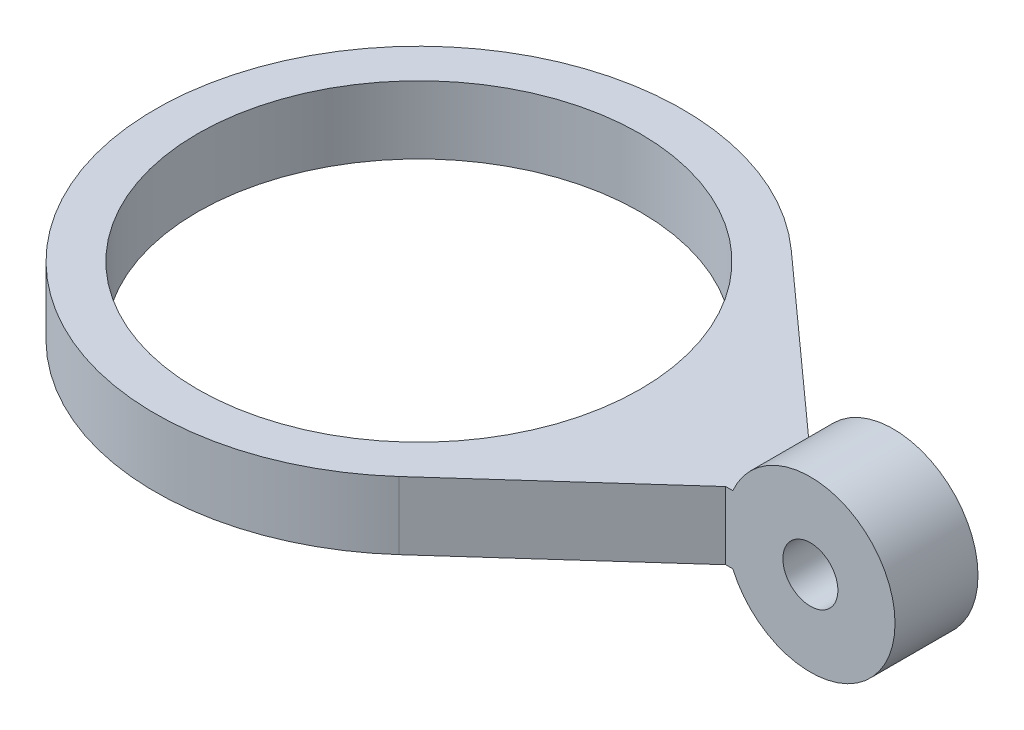
ISO-10303-21;
HEADER;
FILE_DESCRIPTION(('STEP AP214'),'2;1');
FILE_NAME('part.step','',(''),(''),'','','');
FILE_SCHEMA(('AUTOMOTIVE_DESIGN { 1 0 10303 214 1 1 1 1 }'));
ENDSEC;
DATA;
#1=APPLICATION_CONTEXT('core data for automotive mechanical design processes');
#2=APPLICATION_PROTOCOL_DEFINITION('international standard','automotive_design',2000,#1);
#3=PRODUCT_CONTEXT('',#1,'mechanical');
#4=PRODUCT('Part','Part','',(#3));
#5=PRODUCT_RELATED_PRODUCT_CATEGORY('part','',(#4));
#6=PRODUCT_DEFINITION_FORMATION('','',#4);
#7=PRODUCT_DEFINITION_CONTEXT('part definition',#1,'design');
#8=PRODUCT_DEFINITION('design','',#6,#7);
#9=PRODUCT_DEFINITION_SHAPE('','',#8);
#10=(LENGTH_UNIT() NAMED_UNIT(*) SI_UNIT(.MILLI.,.METRE.));
#11=(NAMED_UNIT(*) PLANE_ANGLE_UNIT() SI_UNIT($,.RADIAN.));
#12=(NAMED_UNIT(*) SI_UNIT($,.STERADIAN.) SOLID_ANGLE_UNIT());
#13=UNCERTAINTY_MEASURE_WITH_UNIT(LENGTH_MEASURE(1.E-05),#10,'distance_accuracy_value','');
#14=(GEOMETRIC_REPRESENTATION_CONTEXT(3) GLOBAL_UNCERTAINTY_ASSIGNED_CONTEXT((#13)) GLOBAL_UNIT_ASSIGNED_CONTEXT((#10,
#11,#12)) REPRESENTATION_CONTEXT('',''));
#15=CARTESIAN_POINT('',(0.,0.,0.));
#16=DIRECTION('',(0.,0.,1.));
#17=DIRECTION('',(1.,0.,0.));
#18=AXIS2_PLACEMENT_3D('',#15,#16,#17);
#19=CARTESIAN_POINT('',(0.,4.,0.));
#20=DIRECTION('',(0.,-1.,0.));
#21=DIRECTION('',(0.,0.,-1.));
#22=AXIS2_PLACEMENT_3D('',#19,#20,#21);
#23=CYLINDRICAL_SURFACE('',#22,15.575);
#24=DIRECTION('',(0.,-1.,0.));
#25=VECTOR('',#24,1.);
#26=CARTESIAN_POINT('',(10.4106309826205,29.3004337452201,11.5844459316664));
#27=LINE('',#26,#25);
#28=CARTESIAN_POINT('',(10.4106309826205,4.,11.5844459316664));
#29=VERTEX_POINT('',#28);
#30=CARTESIAN_POINT('',(10.4106309826205,0.,11.5844459316664));
#31=VERTEX_POINT('',#30);
#32=EDGE_CURVE('E107',#29,#31,#27,.T.);
#33=ORIENTED_EDGE('',*,*,#32,.F.);
#34=CARTESIAN_POINT('',(0.,4.,0.));
#35=DIRECTION('',(0.,1.,0.));
#36=DIRECTION('',(0.,0.,1.));
#37=AXIS2_PLACEMENT_3D('',#34,#35,#36);
#38=CIRCLE('',#37,15.575);
#39=CARTESIAN_POINT('',(10.4106309826205,4.,-11.5844459316664));
#40=VERTEX_POINT('',#39);
#41=EDGE_CURVE('E11',#40,#29,#38,.T.);
#42=ORIENTED_EDGE('',*,*,#41,.F.);
#43=DIRECTION('',(0.,-1.,0.));
#44=VECTOR('',#43,1.);
#45=CARTESIAN_POINT('',(10.4106309826205,29.3004337452201,-11.5844459316664));
#46=LINE('',#45,#44);
#47=CARTESIAN_POINT('',(10.4106309826205,0.,-11.5844459316664));
#48=VERTEX_POINT('',#47);
#49=EDGE_CURVE('E117',#40,#48,#46,.T.);
#50=ORIENTED_EDGE('',*,*,#49,.T.);
#51=CARTESIAN_POINT('',(0.,0.,0.));
#52=DIRECTION('',(0.,1.,0.));
#53=DIRECTION('',(0.,0.,1.));
#54=AXIS2_PLACEMENT_3D('',#51,#52,#53);
#55=CIRCLE('',#54,15.575);
#56=EDGE_CURVE('E40',#48,#31,#55,.T.);
#57=ORIENTED_EDGE('',*,*,#56,.T.);
#58=EDGE_LOOP('',(#33,#42,#50,#57));
#59=FACE_BOUND('',#58,.T.);
#60=ADVANCED_FACE('F32',(#59),#23,.T.);
#61=CARTESIAN_POINT('',(0.,4.,0.));
#62=DIRECTION('',(0.,1.,0.));
#63=DIRECTION('',(0.,0.,1.));
#64=AXIS2_PLACEMENT_3D('',#61,#62,#63);
#65=PLANE('',#64);
#66=ORIENTED_EDGE('',*,*,#41,.T.);
#67=DIRECTION('',(0.743784650508274,0.,-0.66841932472684));
#68=VECTOR('',#67,1.);
#69=CARTESIAN_POINT('',(10.4106309826205,4.,11.5844459316664));
#70=LINE('',#69,#68);
#71=CARTESIAN_POINT('',(20.575,4.,2.45));
#72=VERTEX_POINT('',#71);
#73=EDGE_CURVE('E55',#29,#72,#70,.T.);
#74=ORIENTED_EDGE('',*,*,#73,.T.);
#75=DIRECTION('',(-1.,0.,0.));
#76=VECTOR('',#75,1.);
#77=CARTESIAN_POINT('',(20.9924243050442,4.,2.45));
#78=LINE('',#77,#76);
#79=CARTESIAN_POINT('',(20.9924243050442,4.,2.45));
#80=VERTEX_POINT('',#79);
#81=EDGE_CURVE('E85',#80,#72,#78,.T.);
#82=ORIENTED_EDGE('',*,*,#81,.F.);
#83=DIRECTION('',(0.,0.,-1.));
#84=VECTOR('',#83,1.);
#85=CARTESIAN_POINT('',(20.9924243050442,4.,2.45));
#86=LINE('',#85,#84);
#87=CARTESIAN_POINT('',(20.9924243050442,4.,-2.45));
#88=VERTEX_POINT('',#87);
#89=EDGE_CURVE('E90',#80,#88,#86,.T.);
#90=ORIENTED_EDGE('',*,*,#89,.T.);
#91=DIRECTION('',(-1.,0.,0.));
#92=VECTOR('',#91,1.);
#93=CARTESIAN_POINT('',(20.9924243050442,4.,-2.45));
#94=LINE('',#93,#92);
#95=CARTESIAN_POINT('',(20.575,4.,-2.45));
#96=VERTEX_POINT('',#95);
#97=EDGE_CURVE('E245',#88,#96,#94,.T.);
#98=ORIENTED_EDGE('',*,*,#97,.T.);
#99=DIRECTION('',(-0.743784650508274,0.,-0.66841932472684));
#100=VECTOR('',#99,1.);
#101=CARTESIAN_POINT('',(20.575,4.,-2.45));
#102=LINE('',#101,#100);
#103=EDGE_CURVE('E47',#96,#40,#102,.T.);
#104=ORIENTED_EDGE('',*,*,#103,.T.);
#105=EDGE_LOOP('',(#66,#74,#82,#90,#98,#104));
#106=FACE_BOUND('',#105,.T.);
#107=CARTESIAN_POINT('',(0.,4.,0.));
#108=DIRECTION('',(0.,1.,0.));
#109=DIRECTION('',(0.,0.,1.));
#110=AXIS2_PLACEMENT_3D('',#107,#108,#109);
#111=CIRCLE('',#110,13.075);
#112=CARTESIAN_POINT('',(0.,4.,13.075));
#113=VERTEX_POINT('',#112);
#114=EDGE_CURVE('E130',#113,#113,#111,.T.);
#115=ORIENTED_EDGE('',*,*,#114,.F.);
#116=EDGE_LOOP('',(#115));
#117=FACE_BOUND('',#116,.T.);
#118=ADVANCED_FACE('F87',(#106,#117),#65,.T.);
#119=CARTESIAN_POINT('',(0.,0.,0.));
#120=DIRECTION('',(0.,1.,0.));
#121=DIRECTION('',(0.,0.,1.));
#122=AXIS2_PLACEMENT_3D('',#119,#120,#121);
#123=PLANE('',#122);
#124=ORIENTED_EDGE('',*,*,#56,.F.);
#125=DIRECTION('',(-0.743784650508274,0.,-0.66841932472684));
#126=VECTOR('',#125,1.);
#127=CARTESIAN_POINT('',(20.575,0.,-2.45));
#128=LINE('',#127,#126);
#129=CARTESIAN_POINT('',(20.575,0.,-2.45));
#130=VERTEX_POINT('',#129);
#131=EDGE_CURVE('E115',#130,#48,#128,.T.);
#132=ORIENTED_EDGE('',*,*,#131,.F.);
#133=DIRECTION('',(1.,0.,0.));
#134=VECTOR('',#133,1.);
#135=CARTESIAN_POINT('',(20.575,0.,-2.45));
#136=LINE('',#135,#134);
#137=CARTESIAN_POINT('',(20.9924243050442,0.,-2.45));
#138=VERTEX_POINT('',#137);
#139=EDGE_CURVE('E102',#130,#138,#136,.T.);
#140=ORIENTED_EDGE('',*,*,#139,.T.);
#141=DIRECTION('',(0.,0.,-1.));
#142=VECTOR('',#141,1.);
#143=CARTESIAN_POINT('',(20.9924243050442,0.,2.45));
#144=LINE('',#143,#142);
#145=CARTESIAN_POINT('',(20.9924243050442,0.,2.45));
#146=VERTEX_POINT('',#145);
#147=EDGE_CURVE('E108',#146,#138,#144,.T.);
#148=ORIENTED_EDGE('',*,*,#147,.F.);
#149=DIRECTION('',(1.,0.,0.));
#150=VECTOR('',#149,1.);
#151=CARTESIAN_POINT('',(20.575,0.,2.45));
#152=LINE('',#151,#150);
#153=CARTESIAN_POINT('',(20.575,0.,2.45));
#154=VERTEX_POINT('',#153);
#155=EDGE_CURVE('E93',#154,#146,#152,.T.);
#156=ORIENTED_EDGE('',*,*,#155,.F.);
#157=DIRECTION('',(0.743784650508274,0.,-0.66841932472684));
#158=VECTOR('',#157,1.);
#159=CARTESIAN_POINT('',(10.4106309826205,0.,11.5844459316664));
#160=LINE('',#159,#158);
#161=EDGE_CURVE('E110',#31,#154,#160,.T.);
#162=ORIENTED_EDGE('',*,*,#161,.F.);
#163=EDGE_LOOP('',(#124,#132,#140,#148,#156,#162));
#164=FACE_BOUND('',#163,.T.);
#165=CARTESIAN_POINT('',(0.,0.,0.));
#166=DIRECTION('',(0.,1.,0.));
#167=DIRECTION('',(0.,0.,1.));
#168=AXIS2_PLACEMENT_3D('',#165,#166,#167);
#169=CIRCLE('',#168,13.075);
#170=CARTESIAN_POINT('',(0.,0.,13.075));
#171=VERTEX_POINT('',#170);
#172=EDGE_CURVE('E123',#171,#171,#169,.T.);
#173=ORIENTED_EDGE('',*,*,#172,.T.);
#174=EDGE_LOOP('',(#173));
#175=FACE_BOUND('',#174,.T.);
#176=ADVANCED_FACE('F141',(#164,#175),#123,.F.);
#177=CARTESIAN_POINT('',(0.,4.,0.));
#178=DIRECTION('',(0.,-1.,0.));
#179=DIRECTION('',(0.,0.,-1.));
#180=AXIS2_PLACEMENT_3D('',#177,#178,#179);
#181=CYLINDRICAL_SURFACE('',#180,13.075);
#182=ORIENTED_EDGE('',*,*,#114,.T.);
#183=EDGE_LOOP('',(#182));
#184=FACE_BOUND('',#183,.T.);
#185=ORIENTED_EDGE('',*,*,#172,.F.);
#186=EDGE_LOOP('',(#185));
#187=FACE_BOUND('',#186,.T.);
#188=ADVANCED_FACE('F146',(#184,#187),#181,.F.);
#189=CARTESIAN_POINT('',(10.4106309826205,29.3004337452201,11.5844459316664));
#190=DIRECTION('',(-0.66841932472684,0.,-0.743784650508274));
#191=DIRECTION('',(-0.743784650508274,0.,0.66841932472684));
#192=AXIS2_PLACEMENT_3D('',#189,#190,#191);
#193=PLANE('',#192);
#194=ORIENTED_EDGE('',*,*,#73,.F.);
#195=ORIENTED_EDGE('',*,*,#32,.T.);
#196=ORIENTED_EDGE('',*,*,#161,.T.);
#197=DIRECTION('',(0.,-1.,0.));
#198=VECTOR('',#197,1.);
#199=CARTESIAN_POINT('',(20.575,29.3004337452201,2.45));
#200=LINE('',#199,#198);
#201=EDGE_CURVE('E121',#72,#154,#200,.T.);
#202=ORIENTED_EDGE('',*,*,#201,.F.);
#203=EDGE_LOOP('',(#194,#195,#196,#202));
#204=FACE_BOUND('',#203,.T.);
#205=ADVANCED_FACE('F143',(#204),#193,.F.);
#206=CARTESIAN_POINT('',(20.575,29.3004337452201,-2.45));
#207=DIRECTION('',(-0.66841932472684,0.,0.743784650508274));
#208=DIRECTION('',(0.743784650508274,0.,0.66841932472684));
#209=AXIS2_PLACEMENT_3D('',#206,#207,#208);
#210=PLANE('',#209);
#211=ORIENTED_EDGE('',*,*,#103,.F.);
#212=DIRECTION('',(0.,-1.,0.));
#213=VECTOR('',#212,1.);
#214=CARTESIAN_POINT('',(20.575,29.3004337452201,-2.45));
#215=LINE('',#214,#213);
#216=EDGE_CURVE('E118',#96,#130,#215,.T.);
#217=ORIENTED_EDGE('',*,*,#216,.T.);
#218=ORIENTED_EDGE('',*,*,#131,.T.);
#219=ORIENTED_EDGE('',*,*,#49,.F.);
#220=EDGE_LOOP('',(#211,#217,#218,#219));
#221=FACE_BOUND('',#220,.T.);
#222=ADVANCED_FACE('F145',(#221),#210,.F.);
#223=CARTESIAN_POINT('',(25.575,2.,2.45));
#224=DIRECTION('',(0.,0.,-1.));
#225=DIRECTION('',(-1.,0.,0.));
#226=AXIS2_PLACEMENT_3D('',#223,#224,#225);
#227=CYLINDRICAL_SURFACE('',#226,5.);
#228=CARTESIAN_POINT('',(25.575,2.,-2.45));
#229=DIRECTION('',(0.,0.,1.));
#230=DIRECTION('',(1.,0.,0.));
#231=AXIS2_PLACEMENT_3D('',#228,#229,#230);
#232=CIRCLE('',#231,5.);
#233=EDGE_CURVE('E106',#138,#88,#232,.T.);
#234=ORIENTED_EDGE('',*,*,#233,.T.);
#235=ORIENTED_EDGE('',*,*,#89,.F.);
#236=CARTESIAN_POINT('',(25.575,2.,2.45));
#237=DIRECTION('',(0.,0.,1.));
#238=DIRECTION('',(1.,0.,0.));
#239=AXIS2_PLACEMENT_3D('',#236,#237,#238);
#240=CIRCLE('',#239,5.);
#241=EDGE_CURVE('E94',#146,#80,#240,.T.);
#242=ORIENTED_EDGE('',*,*,#241,.F.);
#243=ORIENTED_EDGE('',*,*,#147,.T.);
#244=EDGE_LOOP('',(#234,#235,#242,#243));
#245=FACE_BOUND('',#244,.T.);
#246=ADVANCED_FACE('F104',(#245),#227,.T.);
#247=CARTESIAN_POINT('',(25.575,2.,2.45));
#248=DIRECTION('',(0.,0.,1.));
#249=DIRECTION('',(1.,0.,0.));
#250=AXIS2_PLACEMENT_3D('',#247,#248,#249);
#251=PLANE('',#250);
#252=CARTESIAN_POINT('',(25.575,2.,2.45));
#253=DIRECTION('',(0.,0.,1.));
#254=DIRECTION('',(1.,0.,0.));
#255=AXIS2_PLACEMENT_3D('',#252,#253,#254);
#256=CIRCLE('',#255,1.625);
#257=CARTESIAN_POINT('',(27.2,2.,2.45));
#258=VERTEX_POINT('',#257);
#259=EDGE_CURVE('E242',#258,#258,#256,.T.);
#260=ORIENTED_EDGE('',*,*,#259,.F.);
#261=EDGE_LOOP('',(#260));
#262=FACE_BOUND('',#261,.T.);
#263=ORIENTED_EDGE('',*,*,#241,.T.);
#264=ORIENTED_EDGE('',*,*,#81,.T.);
#265=ORIENTED_EDGE('',*,*,#201,.T.);
#266=ORIENTED_EDGE('',*,*,#155,.T.);
#267=EDGE_LOOP('',(#263,#264,#265,#266));
#268=FACE_BOUND('',#267,.T.);
#269=ADVANCED_FACE('F97',(#262,#268),#251,.T.);
#270=CARTESIAN_POINT('',(25.575,2.,-2.45));
#271=DIRECTION('',(0.,0.,1.));
#272=DIRECTION('',(1.,0.,0.));
#273=AXIS2_PLACEMENT_3D('',#270,#271,#272);
#274=PLANE('',#273);
#275=CARTESIAN_POINT('',(25.575,2.,-2.45));
#276=DIRECTION('',(0.,0.,1.));
#277=DIRECTION('',(1.,0.,0.));
#278=AXIS2_PLACEMENT_3D('',#275,#276,#277);
#279=CIRCLE('',#278,1.625);
#280=CARTESIAN_POINT('',(27.2,2.,-2.45));
#281=VERTEX_POINT('',#280);
#282=EDGE_CURVE('E35',#281,#281,#279,.T.);
#283=ORIENTED_EDGE('',*,*,#282,.T.);
#284=EDGE_LOOP('',(#283));
#285=FACE_BOUND('',#284,.T.);
#286=ORIENTED_EDGE('',*,*,#233,.F.);
#287=ORIENTED_EDGE('',*,*,#139,.F.);
#288=ORIENTED_EDGE('',*,*,#216,.F.);
#289=ORIENTED_EDGE('',*,*,#97,.F.);
#290=EDGE_LOOP('',(#286,#287,#288,#289));
#291=FACE_BOUND('',#290,.T.);
#292=ADVANCED_FACE('F210',(#285,#291),#274,.F.);
#293=CARTESIAN_POINT('',(25.575,2.,-15.575));
#294=DIRECTION('',(0.,0.,1.));
#295=DIRECTION('',(1.,0.,0.));
#296=AXIS2_PLACEMENT_3D('',#293,#294,#295);
#297=CYLINDRICAL_SURFACE('',#296,1.625);
#298=ORIENTED_EDGE('',*,*,#259,.T.);
#299=EDGE_LOOP('',(#298));
#300=FACE_BOUND('',#299,.T.);
#301=ORIENTED_EDGE('',*,*,#282,.F.);
#302=EDGE_LOOP('',(#301));
#303=FACE_BOUND('',#302,.T.);
#304=ADVANCED_FACE('F219',(#300,#303),#297,.F.);
#305=CLOSED_SHELL('',(#60,#118,#176,#188,#205,#222,#246,#269,#292,#304));
#306=MANIFOLD_SOLID_BREP('B2',#305);
#307=ADVANCED_BREP_SHAPE_REPRESENTATION('',(#18,#306),#14);
#308=SHAPE_DEFINITION_REPRESENTATION(#9,#307);
ENDSEC;
END-ISO-10303-21;
